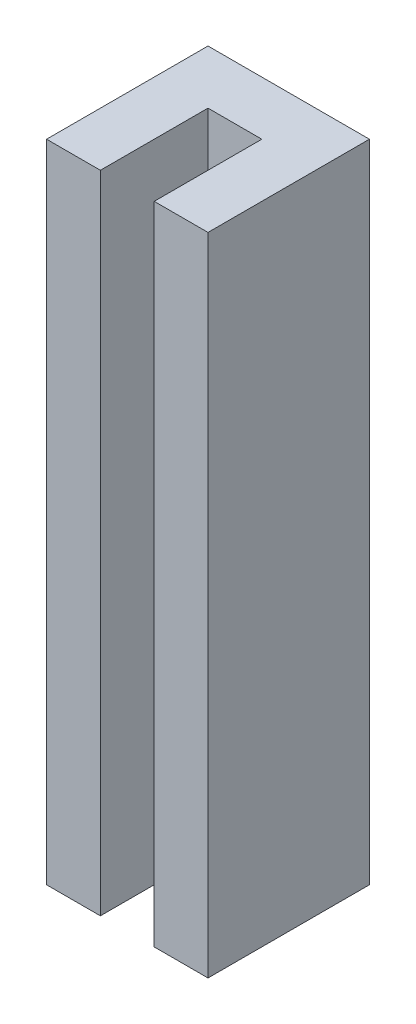
ISO-10303-21;
HEADER;
FILE_DESCRIPTION(('STEP AP214'),'2;1');
FILE_NAME('part.step','',(''),(''),'','','');
FILE_SCHEMA(('AUTOMOTIVE_DESIGN { 1 0 10303 214 1 1 1 1 }'));
ENDSEC;
DATA;
#1=APPLICATION_CONTEXT('core data for automotive mechanical design processes');
#2=APPLICATION_PROTOCOL_DEFINITION('international standard','automotive_design',2000,#1);
#3=PRODUCT_CONTEXT('',#1,'mechanical');
#4=PRODUCT('Part','Part','',(#3));
#5=PRODUCT_RELATED_PRODUCT_CATEGORY('part','',(#4));
#6=PRODUCT_DEFINITION_FORMATION('','',#4);
#7=PRODUCT_DEFINITION_CONTEXT('part definition',#1,'design');
#8=PRODUCT_DEFINITION('design','',#6,#7);
#9=PRODUCT_DEFINITION_SHAPE('','',#8);
#10=(LENGTH_UNIT() NAMED_UNIT(*) SI_UNIT(.MILLI.,.METRE.));
#11=(NAMED_UNIT(*) PLANE_ANGLE_UNIT() SI_UNIT($,.RADIAN.));
#12=(NAMED_UNIT(*) SI_UNIT($,.STERADIAN.) SOLID_ANGLE_UNIT());
#13=UNCERTAINTY_MEASURE_WITH_UNIT(LENGTH_MEASURE(1.E-05),#10,'distance_accuracy_value','');
#14=(GEOMETRIC_REPRESENTATION_CONTEXT(3) GLOBAL_UNCERTAINTY_ASSIGNED_CONTEXT((#13)) GLOBAL_UNIT_ASSIGNED_CONTEXT((#10,
#11,#12)) REPRESENTATION_CONTEXT('',''));
#15=CARTESIAN_POINT('',(0.,0.,0.));
#16=DIRECTION('',(0.,0.,1.));
#17=DIRECTION('',(1.,0.,0.));
#18=AXIS2_PLACEMENT_3D('',#15,#16,#17);
#19=CARTESIAN_POINT('',(4.7625,19.05,4.7625));
#20=DIRECTION('',(-1.,0.,0.));
#21=DIRECTION('',(0.,0.,1.));
#22=AXIS2_PLACEMENT_3D('',#19,#20,#21);
#23=PLANE('',#22);
#24=DIRECTION('',(0.,0.,-1.));
#25=VECTOR('',#24,1.);
#26=CARTESIAN_POINT('',(4.7625,-19.05,4.7625));
#27=LINE('',#26,#25);
#28=CARTESIAN_POINT('',(4.7625,-19.05,4.7625));
#29=VERTEX_POINT('',#28);
#30=CARTESIAN_POINT('',(4.7625,-19.05,-4.7625));
#31=VERTEX_POINT('',#30);
#32=EDGE_CURVE('E129',#29,#31,#27,.T.);
#33=ORIENTED_EDGE('',*,*,#32,.T.);
#34=DIRECTION('',(0.,-1.,0.));
#35=VECTOR('',#34,1.);
#36=CARTESIAN_POINT('',(4.7625,19.05,-4.7625));
#37=LINE('',#36,#35);
#38=CARTESIAN_POINT('',(4.7625,19.05,-4.7625));
#39=VERTEX_POINT('',#38);
#40=EDGE_CURVE('E11',#39,#31,#37,.T.);
#41=ORIENTED_EDGE('',*,*,#40,.F.);
#42=DIRECTION('',(0.,0.,-1.));
#43=VECTOR('',#42,1.);
#44=CARTESIAN_POINT('',(4.7625,19.05,4.7625));
#45=LINE('',#44,#43);
#46=CARTESIAN_POINT('',(4.7625,19.05,4.7625));
#47=VERTEX_POINT('',#46);
#48=EDGE_CURVE('E144',#47,#39,#45,.T.);
#49=ORIENTED_EDGE('',*,*,#48,.F.);
#50=DIRECTION('',(0.,-1.,0.));
#51=VECTOR('',#50,1.);
#52=CARTESIAN_POINT('',(4.7625,19.05,4.7625));
#53=LINE('',#52,#51);
#54=EDGE_CURVE('E125',#47,#29,#53,.T.);
#55=ORIENTED_EDGE('',*,*,#54,.T.);
#56=EDGE_LOOP('',(#33,#41,#49,#55));
#57=FACE_BOUND('',#56,.T.);
#58=ADVANCED_FACE('F31',(#57),#23,.F.);
#59=CARTESIAN_POINT('',(-4.7625,19.05,-4.7625));
#60=DIRECTION('',(0.,0.,1.));
#61=DIRECTION('',(1.,0.,0.));
#62=AXIS2_PLACEMENT_3D('',#59,#60,#61);
#63=PLANE('',#62);
#64=CARTESIAN_POINT('',(0.,7.9375,-4.7625));
#65=DIRECTION('',(0.,0.,-1.));
#66=DIRECTION('',(-1.,0.,0.));
#67=AXIS2_PLACEMENT_3D('',#64,#65,#66);
#68=CIRCLE('',#67,1.42239999999982);
#69=CARTESIAN_POINT('',(-1.42239999999983,7.9375,-4.7625));
#70=VERTEX_POINT('',#69);
#71=EDGE_CURVE('E164',#70,#70,#68,.T.);
#72=ORIENTED_EDGE('',*,*,#71,.F.);
#73=EDGE_LOOP('',(#72));
#74=FACE_BOUND('',#73,.T.);
#75=CARTESIAN_POINT('',(0.,-14.2875,-4.76250000000001));
#76=DIRECTION('',(0.,0.,-1.));
#77=DIRECTION('',(-1.,0.,0.));
#78=AXIS2_PLACEMENT_3D('',#75,#76,#77);
#79=CIRCLE('',#78,1.42239999999982);
#80=CARTESIAN_POINT('',(-1.42239999999983,-14.2875,-4.76250000000001));
#81=VERTEX_POINT('',#80);
#82=EDGE_CURVE('E156',#81,#81,#79,.T.);
#83=ORIENTED_EDGE('',*,*,#82,.F.);
#84=EDGE_LOOP('',(#83));
#85=FACE_BOUND('',#84,.T.);
#86=DIRECTION('',(-1.,0.,0.));
#87=VECTOR('',#86,1.);
#88=CARTESIAN_POINT('',(-4.7625,-19.05,-4.7625));
#89=LINE('',#88,#87);
#90=CARTESIAN_POINT('',(-4.7625,-19.05,-4.7625));
#91=VERTEX_POINT('',#90);
#92=EDGE_CURVE('E132',#31,#91,#89,.T.);
#93=ORIENTED_EDGE('',*,*,#92,.T.);
#94=DIRECTION('',(0.,-1.,0.));
#95=VECTOR('',#94,1.);
#96=CARTESIAN_POINT('',(-4.7625,19.05,-4.7625));
#97=LINE('',#96,#95);
#98=CARTESIAN_POINT('',(-4.7625,19.05,-4.7625));
#99=VERTEX_POINT('',#98);
#100=EDGE_CURVE('E40',#99,#91,#97,.T.);
#101=ORIENTED_EDGE('',*,*,#100,.F.);
#102=DIRECTION('',(-1.,0.,0.));
#103=VECTOR('',#102,1.);
#104=CARTESIAN_POINT('',(-4.7625,19.05,-4.7625));
#105=LINE('',#104,#103);
#106=EDGE_CURVE('E92',#39,#99,#105,.T.);
#107=ORIENTED_EDGE('',*,*,#106,.F.);
#108=ORIENTED_EDGE('',*,*,#40,.T.);
#109=EDGE_LOOP('',(#93,#101,#107,#108));
#110=FACE_BOUND('',#109,.T.);
#111=ADVANCED_FACE('F200',(#74,#85,#110),#63,.F.);
#112=CARTESIAN_POINT('',(-4.7625,19.05,4.7625));
#113=DIRECTION('',(1.,0.,0.));
#114=DIRECTION('',(0.,0.,-1.));
#115=AXIS2_PLACEMENT_3D('',#112,#113,#114);
#116=PLANE('',#115);
#117=DIRECTION('',(0.,0.,1.));
#118=VECTOR('',#117,1.);
#119=CARTESIAN_POINT('',(-4.7625,-19.05,4.7625));
#120=LINE('',#119,#118);
#121=CARTESIAN_POINT('',(-4.7625,-19.05,4.7625));
#122=VERTEX_POINT('',#121);
#123=EDGE_CURVE('E135',#91,#122,#120,.T.);
#124=ORIENTED_EDGE('',*,*,#123,.T.);
#125=DIRECTION('',(0.,-1.,0.));
#126=VECTOR('',#125,1.);
#127=CARTESIAN_POINT('',(-4.7625,19.05,4.7625));
#128=LINE('',#127,#126);
#129=CARTESIAN_POINT('',(-4.7625,19.05,4.7625));
#130=VERTEX_POINT('',#129);
#131=EDGE_CURVE('E151',#130,#122,#128,.T.);
#132=ORIENTED_EDGE('',*,*,#131,.F.);
#133=DIRECTION('',(0.,0.,1.));
#134=VECTOR('',#133,1.);
#135=CARTESIAN_POINT('',(-4.7625,19.05,4.7625));
#136=LINE('',#135,#134);
#137=EDGE_CURVE('E169',#99,#130,#136,.T.);
#138=ORIENTED_EDGE('',*,*,#137,.F.);
#139=ORIENTED_EDGE('',*,*,#100,.T.);
#140=EDGE_LOOP('',(#124,#132,#138,#139));
#141=FACE_BOUND('',#140,.T.);
#142=ADVANCED_FACE('F204',(#141),#116,.F.);
#143=CARTESIAN_POINT('',(-4.7625,19.05,4.7625));
#144=DIRECTION('',(0.,0.,-1.));
#145=DIRECTION('',(-1.,0.,0.));
#146=AXIS2_PLACEMENT_3D('',#143,#144,#145);
#147=PLANE('',#146);
#148=DIRECTION('',(1.,0.,0.));
#149=VECTOR('',#148,1.);
#150=CARTESIAN_POINT('',(-4.7625,-19.05,4.7625));
#151=LINE('',#150,#149);
#152=CARTESIAN_POINT('',(-1.5875,-19.05,4.7625));
#153=VERTEX_POINT('',#152);
#154=EDGE_CURVE('E137',#122,#153,#151,.T.);
#155=ORIENTED_EDGE('',*,*,#154,.T.);
#156=DIRECTION('',(0.,-1.,0.));
#157=VECTOR('',#156,1.);
#158=CARTESIAN_POINT('',(-1.5875,19.05,4.7625));
#159=LINE('',#158,#157);
#160=CARTESIAN_POINT('',(-1.5875,19.05,4.7625));
#161=VERTEX_POINT('',#160);
#162=EDGE_CURVE('E148',#161,#153,#159,.T.);
#163=ORIENTED_EDGE('',*,*,#162,.F.);
#164=DIRECTION('',(1.,0.,0.));
#165=VECTOR('',#164,1.);
#166=CARTESIAN_POINT('',(-4.7625,19.05,4.7625));
#167=LINE('',#166,#165);
#168=EDGE_CURVE('E171',#130,#161,#167,.T.);
#169=ORIENTED_EDGE('',*,*,#168,.F.);
#170=ORIENTED_EDGE('',*,*,#131,.T.);
#171=EDGE_LOOP('',(#155,#163,#169,#170));
#172=FACE_BOUND('',#171,.T.);
#173=ADVANCED_FACE('F177',(#172),#147,.F.);
#174=CARTESIAN_POINT('',(-1.5875,19.05,-1.5875));
#175=DIRECTION('',(-1.,0.,0.));
#176=DIRECTION('',(0.,0.,1.));
#177=AXIS2_PLACEMENT_3D('',#174,#175,#176);
#178=PLANE('',#177);
#179=DIRECTION('',(0.,0.,-1.));
#180=VECTOR('',#179,1.);
#181=CARTESIAN_POINT('',(-1.5875,-19.05,-1.5875));
#182=LINE('',#181,#180);
#183=CARTESIAN_POINT('',(-1.5875,-19.05,-1.5875));
#184=VERTEX_POINT('',#183);
#185=EDGE_CURVE('E139',#153,#184,#182,.T.);
#186=ORIENTED_EDGE('',*,*,#185,.T.);
#187=DIRECTION('',(0.,-1.,0.));
#188=VECTOR('',#187,1.);
#189=CARTESIAN_POINT('',(-1.5875,19.05,-1.5875));
#190=LINE('',#189,#188);
#191=CARTESIAN_POINT('',(-1.5875,19.05,-1.5875));
#192=VERTEX_POINT('',#191);
#193=EDGE_CURVE('E120',#192,#184,#190,.T.);
#194=ORIENTED_EDGE('',*,*,#193,.F.);
#195=DIRECTION('',(0.,0.,-1.));
#196=VECTOR('',#195,1.);
#197=CARTESIAN_POINT('',(-1.5875,19.05,-1.5875));
#198=LINE('',#197,#196);
#199=EDGE_CURVE('E111',#161,#192,#198,.T.);
#200=ORIENTED_EDGE('',*,*,#199,.F.);
#201=ORIENTED_EDGE('',*,*,#162,.T.);
#202=EDGE_LOOP('',(#186,#194,#200,#201));
#203=FACE_BOUND('',#202,.T.);
#204=ADVANCED_FACE('F181',(#203),#178,.F.);
#205=CARTESIAN_POINT('',(-1.5875,19.05,-1.5875));
#206=DIRECTION('',(0.,0.,-1.));
#207=DIRECTION('',(-1.,0.,0.));
#208=AXIS2_PLACEMENT_3D('',#205,#206,#207);
#209=PLANE('',#208);
#210=CARTESIAN_POINT('',(0.,7.9375,-1.5875));
#211=DIRECTION('',(0.,0.,-1.));
#212=DIRECTION('',(-1.,0.,0.));
#213=AXIS2_PLACEMENT_3D('',#210,#211,#212);
#214=CIRCLE('',#213,1.42239999999982);
#215=CARTESIAN_POINT('',(-1.42239999999983,7.9375,-1.5875));
#216=VERTEX_POINT('',#215);
#217=EDGE_CURVE('E34',#216,#216,#214,.T.);
#218=ORIENTED_EDGE('',*,*,#217,.T.);
#219=EDGE_LOOP('',(#218));
#220=FACE_BOUND('',#219,.T.);
#221=CARTESIAN_POINT('',(0.,-14.2875,-1.5875));
#222=DIRECTION('',(0.,0.,-1.));
#223=DIRECTION('',(-1.,0.,0.));
#224=AXIS2_PLACEMENT_3D('',#221,#222,#223);
#225=CIRCLE('',#224,1.42239999999982);
#226=CARTESIAN_POINT('',(-1.42239999999983,-14.2875,-1.5875));
#227=VERTEX_POINT('',#226);
#228=EDGE_CURVE('E133',#227,#227,#225,.T.);
#229=ORIENTED_EDGE('',*,*,#228,.T.);
#230=EDGE_LOOP('',(#229));
#231=FACE_BOUND('',#230,.T.);
#232=DIRECTION('',(1.,0.,0.));
#233=VECTOR('',#232,1.);
#234=CARTESIAN_POINT('',(-1.5875,-19.05,-1.5875));
#235=LINE('',#234,#233);
#236=CARTESIAN_POINT('',(1.5875,-19.05,-1.5875));
#237=VERTEX_POINT('',#236);
#238=EDGE_CURVE('E119',#184,#237,#235,.T.);
#239=ORIENTED_EDGE('',*,*,#238,.T.);
#240=DIRECTION('',(0.,-1.,0.));
#241=VECTOR('',#240,1.);
#242=CARTESIAN_POINT('',(1.5875,19.05,-1.5875));
#243=LINE('',#242,#241);
#244=CARTESIAN_POINT('',(1.5875,19.05,-1.5875));
#245=VERTEX_POINT('',#244);
#246=EDGE_CURVE('E116',#245,#237,#243,.T.);
#247=ORIENTED_EDGE('',*,*,#246,.F.);
#248=DIRECTION('',(1.,0.,0.));
#249=VECTOR('',#248,1.);
#250=CARTESIAN_POINT('',(-1.5875,19.05,-1.5875));
#251=LINE('',#250,#249);
#252=EDGE_CURVE('E105',#192,#245,#251,.T.);
#253=ORIENTED_EDGE('',*,*,#252,.F.);
#254=ORIENTED_EDGE('',*,*,#193,.T.);
#255=EDGE_LOOP('',(#239,#247,#253,#254));
#256=FACE_BOUND('',#255,.T.);
#257=ADVANCED_FACE('F117',(#220,#231,#256),#209,.F.);
#258=CARTESIAN_POINT('',(1.5875,19.05,-1.5875));
#259=DIRECTION('',(1.,0.,0.));
#260=DIRECTION('',(0.,0.,-1.));
#261=AXIS2_PLACEMENT_3D('',#258,#259,#260);
#262=PLANE('',#261);
#263=DIRECTION('',(0.,0.,1.));
#264=VECTOR('',#263,1.);
#265=CARTESIAN_POINT('',(1.5875,-19.05,-1.5875));
#266=LINE('',#265,#264);
#267=CARTESIAN_POINT('',(1.5875,-19.05,4.7625));
#268=VERTEX_POINT('',#267);
#269=EDGE_CURVE('E78',#237,#268,#266,.T.);
#270=ORIENTED_EDGE('',*,*,#269,.T.);
#271=DIRECTION('',(0.,-1.,0.));
#272=VECTOR('',#271,1.);
#273=CARTESIAN_POINT('',(1.5875,19.05,4.7625));
#274=LINE('',#273,#272);
#275=CARTESIAN_POINT('',(1.5875,19.05,4.7625));
#276=VERTEX_POINT('',#275);
#277=EDGE_CURVE('E121',#276,#268,#274,.T.);
#278=ORIENTED_EDGE('',*,*,#277,.F.);
#279=DIRECTION('',(0.,0.,1.));
#280=VECTOR('',#279,1.);
#281=CARTESIAN_POINT('',(1.5875,19.05,-1.5875));
#282=LINE('',#281,#280);
#283=EDGE_CURVE('E109',#245,#276,#282,.T.);
#284=ORIENTED_EDGE('',*,*,#283,.F.);
#285=ORIENTED_EDGE('',*,*,#246,.T.);
#286=EDGE_LOOP('',(#270,#278,#284,#285));
#287=FACE_BOUND('',#286,.T.);
#288=ADVANCED_FACE('F123',(#287),#262,.F.);
#289=CARTESIAN_POINT('',(1.5875,19.05,4.7625));
#290=DIRECTION('',(0.,0.,-1.));
#291=DIRECTION('',(-1.,0.,0.));
#292=AXIS2_PLACEMENT_3D('',#289,#290,#291);
#293=PLANE('',#292);
#294=DIRECTION('',(1.,0.,0.));
#295=VECTOR('',#294,1.);
#296=CARTESIAN_POINT('',(1.5875,-19.05,4.7625));
#297=LINE('',#296,#295);
#298=EDGE_CURVE('E84',#268,#29,#297,.T.);
#299=ORIENTED_EDGE('',*,*,#298,.T.);
#300=ORIENTED_EDGE('',*,*,#54,.F.);
#301=DIRECTION('',(1.,0.,0.));
#302=VECTOR('',#301,1.);
#303=CARTESIAN_POINT('',(1.5875,19.05,4.7625));
#304=LINE('',#303,#302);
#305=EDGE_CURVE('E49',#276,#47,#304,.T.);
#306=ORIENTED_EDGE('',*,*,#305,.F.);
#307=ORIENTED_EDGE('',*,*,#277,.T.);
#308=EDGE_LOOP('',(#299,#300,#306,#307));
#309=FACE_BOUND('',#308,.T.);
#310=ADVANCED_FACE('F189',(#309),#293,.F.);
#311=CARTESIAN_POINT('',(4.7625,19.05,-4.7625));
#312=DIRECTION('',(0.,-1.,0.));
#313=DIRECTION('',(0.,0.,-1.));
#314=AXIS2_PLACEMENT_3D('',#311,#312,#313);
#315=PLANE('',#314);
#316=ORIENTED_EDGE('',*,*,#48,.T.);
#317=ORIENTED_EDGE('',*,*,#106,.T.);
#318=ORIENTED_EDGE('',*,*,#137,.T.);
#319=ORIENTED_EDGE('',*,*,#168,.T.);
#320=ORIENTED_EDGE('',*,*,#199,.T.);
#321=ORIENTED_EDGE('',*,*,#252,.T.);
#322=ORIENTED_EDGE('',*,*,#283,.T.);
#323=ORIENTED_EDGE('',*,*,#305,.T.);
#324=EDGE_LOOP('',(#316,#317,#318,#319,#320,#321,#322,#323));
#325=FACE_BOUND('',#324,.T.);
#326=ADVANCED_FACE('F107',(#325),#315,.F.);
#327=CARTESIAN_POINT('',(4.7625,-19.05,-4.7625));
#328=DIRECTION('',(0.,-1.,0.));
#329=DIRECTION('',(0.,0.,-1.));
#330=AXIS2_PLACEMENT_3D('',#327,#328,#329);
#331=PLANE('',#330);
#332=ORIENTED_EDGE('',*,*,#32,.F.);
#333=ORIENTED_EDGE('',*,*,#298,.F.);
#334=ORIENTED_EDGE('',*,*,#269,.F.);
#335=ORIENTED_EDGE('',*,*,#238,.F.);
#336=ORIENTED_EDGE('',*,*,#185,.F.);
#337=ORIENTED_EDGE('',*,*,#154,.F.);
#338=ORIENTED_EDGE('',*,*,#123,.F.);
#339=ORIENTED_EDGE('',*,*,#92,.F.);
#340=EDGE_LOOP('',(#332,#333,#334,#335,#336,#337,#338,#339));
#341=FACE_BOUND('',#340,.T.);
#342=ADVANCED_FACE('F184',(#341),#331,.T.);
#343=CARTESIAN_POINT('',(0.,-14.2875,-4.76250000000001));
#344=DIRECTION('',(0.,0.,-1.));
#345=DIRECTION('',(-1.,0.,0.));
#346=AXIS2_PLACEMENT_3D('',#343,#344,#345);
#347=CYLINDRICAL_SURFACE('',#346,1.42239999999982);
#348=ORIENTED_EDGE('',*,*,#82,.T.);
#349=EDGE_LOOP('',(#348));
#350=FACE_BOUND('',#349,.T.);
#351=ORIENTED_EDGE('',*,*,#228,.F.);
#352=EDGE_LOOP('',(#351));
#353=FACE_BOUND('',#352,.T.);
#354=ADVANCED_FACE('F226',(#350,#353),#347,.F.);
#355=CARTESIAN_POINT('',(0.,7.9375,-4.7625));
#356=DIRECTION('',(0.,0.,-1.));
#357=DIRECTION('',(-1.,0.,0.));
#358=AXIS2_PLACEMENT_3D('',#355,#356,#357);
#359=CYLINDRICAL_SURFACE('',#358,1.42239999999982);
#360=ORIENTED_EDGE('',*,*,#71,.T.);
#361=EDGE_LOOP('',(#360));
#362=FACE_BOUND('',#361,.T.);
#363=ORIENTED_EDGE('',*,*,#217,.F.);
#364=EDGE_LOOP('',(#363));
#365=FACE_BOUND('',#364,.T.);
#366=ADVANCED_FACE('F224',(#362,#365),#359,.F.);
#367=CLOSED_SHELL('',(#58,#111,#142,#173,#204,#257,#288,#310,#326,#342,#354,#366));
#368=MANIFOLD_SOLID_BREP('B2',#367);
#369=ADVANCED_BREP_SHAPE_REPRESENTATION('',(#18,#368),#14);
#370=SHAPE_DEFINITION_REPRESENTATION(#9,#369);
ENDSEC;
END-ISO-10303-21;
